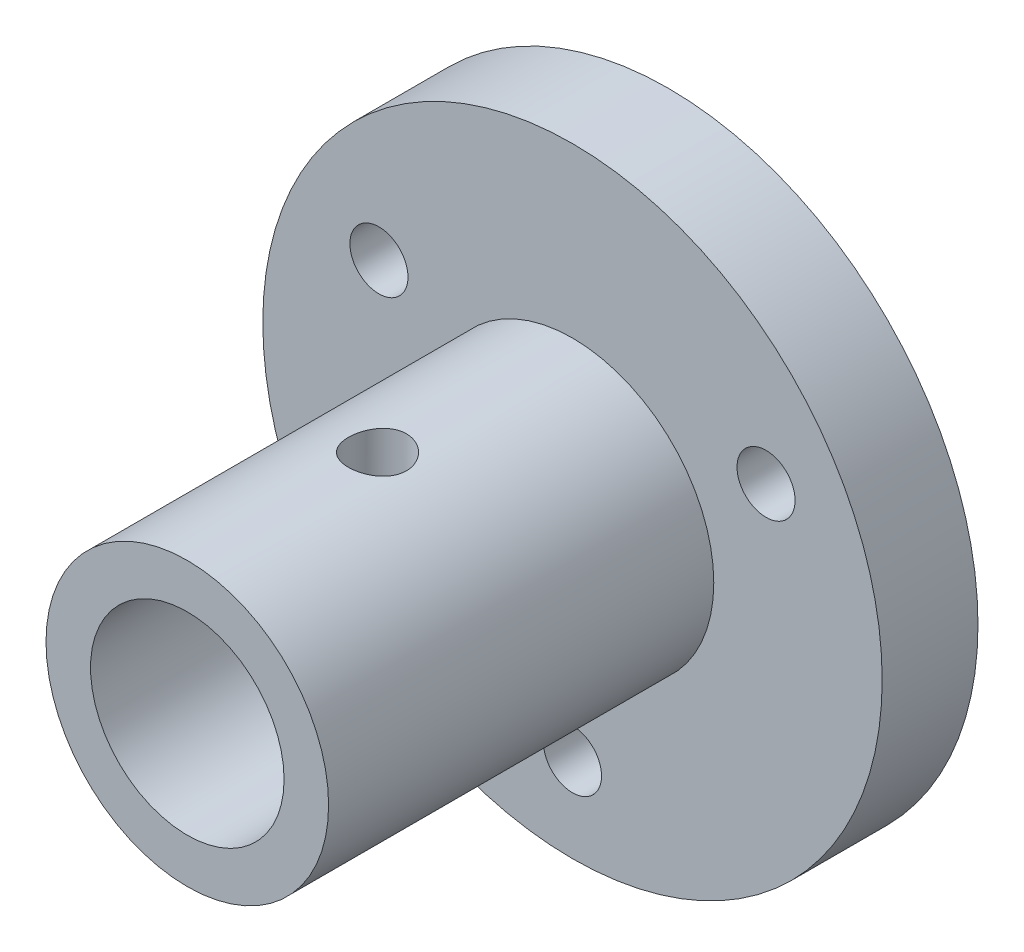
ISO-10303-21;
HEADER;
FILE_DESCRIPTION(('STEP AP214'),'2;1');
FILE_NAME('part.step','',(''),(''),'','','');
FILE_SCHEMA(('AUTOMOTIVE_DESIGN { 1 0 10303 214 1 1 1 1 }'));
ENDSEC;
DATA;
#1=APPLICATION_CONTEXT('core data for automotive mechanical design processes');
#2=APPLICATION_PROTOCOL_DEFINITION('international standard','automotive_design',2000,#1);
#3=PRODUCT_CONTEXT('',#1,'mechanical');
#4=PRODUCT('Part','Part','',(#3));
#5=PRODUCT_RELATED_PRODUCT_CATEGORY('part','',(#4));
#6=PRODUCT_DEFINITION_FORMATION('','',#4);
#7=PRODUCT_DEFINITION_CONTEXT('part definition',#1,'design');
#8=PRODUCT_DEFINITION('design','',#6,#7);
#9=PRODUCT_DEFINITION_SHAPE('','',#8);
#10=(LENGTH_UNIT() NAMED_UNIT(*) SI_UNIT(.MILLI.,.METRE.));
#11=(NAMED_UNIT(*) PLANE_ANGLE_UNIT() SI_UNIT($,.RADIAN.));
#12=(NAMED_UNIT(*) SI_UNIT($,.STERADIAN.) SOLID_ANGLE_UNIT());
#13=UNCERTAINTY_MEASURE_WITH_UNIT(LENGTH_MEASURE(1.E-05),#10,'distance_accuracy_value','');
#14=(GEOMETRIC_REPRESENTATION_CONTEXT(3) GLOBAL_UNCERTAINTY_ASSIGNED_CONTEXT((#13)) GLOBAL_UNIT_ASSIGNED_CONTEXT((#10,
#11,#12)) REPRESENTATION_CONTEXT('',''));
#15=CARTESIAN_POINT('',(0.,0.,0.));
#16=DIRECTION('',(0.,0.,1.));
#17=DIRECTION('',(1.,0.,0.));
#18=AXIS2_PLACEMENT_3D('',#15,#16,#17);
#19=CARTESIAN_POINT('',(0.,0.,9.9));
#20=DIRECTION('',(0.,0.,1.));
#21=DIRECTION('',(1.,0.,0.));
#22=AXIS2_PLACEMENT_3D('',#19,#20,#21);
#23=PLANE('',#22);
#24=CARTESIAN_POINT('',(0.,0.,9.9));
#25=DIRECTION('',(0.,0.,1.));
#26=DIRECTION('',(1.,0.,0.));
#27=AXIS2_PLACEMENT_3D('',#24,#25,#26);
#28=CIRCLE('',#27,14.6);
#29=CARTESIAN_POINT('',(14.6,0.,9.9));
#30=VERTEX_POINT('',#29);
#31=EDGE_CURVE('E144',#30,#30,#28,.T.);
#32=ORIENTED_EDGE('',*,*,#31,.F.);
#33=EDGE_LOOP('',(#32));
#34=FACE_BOUND('',#33,.T.);
#35=CARTESIAN_POINT('',(0.,-23.094010767585,9.9));
#36=DIRECTION('',(0.,0.,1.));
#37=DIRECTION('',(1.,0.,0.));
#38=AXIS2_PLACEMENT_3D('',#35,#36,#37);
#39=CIRCLE('',#38,3.);
#40=CARTESIAN_POINT('',(3.,-23.094010767585,9.9));
#41=VERTEX_POINT('',#40);
#42=EDGE_CURVE('E148',#41,#41,#39,.T.);
#43=ORIENTED_EDGE('',*,*,#42,.F.);
#44=EDGE_LOOP('',(#43));
#45=FACE_BOUND('',#44,.T.);
#46=CARTESIAN_POINT('',(0.,0.,9.9));
#47=DIRECTION('',(0.,0.,1.));
#48=DIRECTION('',(1.,0.,0.));
#49=AXIS2_PLACEMENT_3D('',#46,#47,#48);
#50=CIRCLE('',#49,32.);
#51=CARTESIAN_POINT('',(32.,0.,9.9));
#52=VERTEX_POINT('',#51);
#53=EDGE_CURVE('E51',#52,#52,#50,.T.);
#54=ORIENTED_EDGE('',*,*,#53,.T.);
#55=EDGE_LOOP('',(#54));
#56=FACE_BOUND('',#55,.T.);
#57=CARTESIAN_POINT('',(20.,11.5470053837925,9.9));
#58=DIRECTION('',(0.,0.,1.));
#59=DIRECTION('',(1.,0.,0.));
#60=AXIS2_PLACEMENT_3D('',#57,#58,#59);
#61=CIRCLE('',#60,3.);
#62=CARTESIAN_POINT('',(23.,11.5470053837925,9.9));
#63=VERTEX_POINT('',#62);
#64=EDGE_CURVE('E154',#63,#63,#61,.T.);
#65=ORIENTED_EDGE('',*,*,#64,.F.);
#66=EDGE_LOOP('',(#65));
#67=FACE_BOUND('',#66,.T.);
#68=CARTESIAN_POINT('',(-20.,11.5470053837925,9.9));
#69=DIRECTION('',(0.,0.,1.));
#70=DIRECTION('',(1.,0.,0.));
#71=AXIS2_PLACEMENT_3D('',#68,#69,#70);
#72=CIRCLE('',#71,3.);
#73=CARTESIAN_POINT('',(-17.,11.5470053837925,9.9));
#74=VERTEX_POINT('',#73);
#75=EDGE_CURVE('E136',#74,#74,#72,.T.);
#76=ORIENTED_EDGE('',*,*,#75,.F.);
#77=EDGE_LOOP('',(#76));
#78=FACE_BOUND('',#77,.T.);
#79=ADVANCED_FACE('F37',(#34,#45,#56,#67,#78),#23,.T.);
#80=CARTESIAN_POINT('',(0.,0.,0.));
#81=DIRECTION('',(0.,0.,1.));
#82=DIRECTION('',(1.,0.,0.));
#83=AXIS2_PLACEMENT_3D('',#80,#81,#82);
#84=PLANE('',#83);
#85=CARTESIAN_POINT('',(0.,0.,0.));
#86=DIRECTION('',(0.,0.,1.));
#87=DIRECTION('',(1.,0.,0.));
#88=AXIS2_PLACEMENT_3D('',#85,#86,#87);
#89=CIRCLE('',#88,32.);
#90=CARTESIAN_POINT('',(32.,0.,0.));
#91=VERTEX_POINT('',#90);
#92=EDGE_CURVE('E57',#91,#91,#89,.T.);
#93=ORIENTED_EDGE('',*,*,#92,.F.);
#94=EDGE_LOOP('',(#93));
#95=FACE_BOUND('',#94,.T.);
#96=CARTESIAN_POINT('',(20.,11.5470053837925,0.));
#97=DIRECTION('',(0.,0.,1.));
#98=DIRECTION('',(1.,0.,0.));
#99=AXIS2_PLACEMENT_3D('',#96,#97,#98);
#100=CIRCLE('',#99,3.);
#101=CARTESIAN_POINT('',(23.,11.5470053837925,0.));
#102=VERTEX_POINT('',#101);
#103=EDGE_CURVE('E126',#102,#102,#100,.T.);
#104=ORIENTED_EDGE('',*,*,#103,.T.);
#105=EDGE_LOOP('',(#104));
#106=FACE_BOUND('',#105,.T.);
#107=CARTESIAN_POINT('',(0.,-23.094010767585,0.));
#108=DIRECTION('',(0.,0.,1.));
#109=DIRECTION('',(1.,0.,0.));
#110=AXIS2_PLACEMENT_3D('',#107,#108,#109);
#111=CIRCLE('',#110,3.);
#112=CARTESIAN_POINT('',(3.,-23.094010767585,0.));
#113=VERTEX_POINT('',#112);
#114=EDGE_CURVE('E130',#113,#113,#111,.T.);
#115=ORIENTED_EDGE('',*,*,#114,.T.);
#116=EDGE_LOOP('',(#115));
#117=FACE_BOUND('',#116,.T.);
#118=CARTESIAN_POINT('',(-20.,11.5470053837925,0.));
#119=DIRECTION('',(0.,0.,1.));
#120=DIRECTION('',(1.,0.,0.));
#121=AXIS2_PLACEMENT_3D('',#118,#119,#120);
#122=CIRCLE('',#121,3.);
#123=CARTESIAN_POINT('',(-17.,11.5470053837925,0.));
#124=VERTEX_POINT('',#123);
#125=EDGE_CURVE('E133',#124,#124,#122,.T.);
#126=ORIENTED_EDGE('',*,*,#125,.T.);
#127=EDGE_LOOP('',(#126));
#128=FACE_BOUND('',#127,.T.);
#129=ADVANCED_FACE('F111',(#95,#106,#117,#128),#84,.F.);
#130=CARTESIAN_POINT('',(0.,0.,9.9));
#131=DIRECTION('',(0.,0.,-1.));
#132=DIRECTION('',(-1.,0.,0.));
#133=AXIS2_PLACEMENT_3D('',#130,#131,#132);
#134=CYLINDRICAL_SURFACE('',#133,32.);
#135=ORIENTED_EDGE('',*,*,#53,.F.);
#136=EDGE_LOOP('',(#135));
#137=FACE_BOUND('',#136,.T.);
#138=ORIENTED_EDGE('',*,*,#92,.T.);
#139=EDGE_LOOP('',(#138));
#140=FACE_BOUND('',#139,.T.);
#141=ADVANCED_FACE('F39',(#137,#140),#134,.T.);
#142=CARTESIAN_POINT('',(20.,11.5470053837925,9.9));
#143=DIRECTION('',(0.,0.,-1.));
#144=DIRECTION('',(-1.,0.,0.));
#145=AXIS2_PLACEMENT_3D('',#142,#143,#144);
#146=CYLINDRICAL_SURFACE('',#145,3.);
#147=ORIENTED_EDGE('',*,*,#64,.T.);
#148=EDGE_LOOP('',(#147));
#149=FACE_BOUND('',#148,.T.);
#150=ORIENTED_EDGE('',*,*,#103,.F.);
#151=EDGE_LOOP('',(#150));
#152=FACE_BOUND('',#151,.T.);
#153=ADVANCED_FACE('F105',(#149,#152),#146,.F.);
#154=CARTESIAN_POINT('',(0.,-23.094010767585,9.9));
#155=DIRECTION('',(0.,0.,-1.));
#156=DIRECTION('',(-1.,0.,0.));
#157=AXIS2_PLACEMENT_3D('',#154,#155,#156);
#158=CYLINDRICAL_SURFACE('',#157,3.);
#159=ORIENTED_EDGE('',*,*,#42,.T.);
#160=EDGE_LOOP('',(#159));
#161=FACE_BOUND('',#160,.T.);
#162=ORIENTED_EDGE('',*,*,#114,.F.);
#163=EDGE_LOOP('',(#162));
#164=FACE_BOUND('',#163,.T.);
#165=ADVANCED_FACE('F101',(#161,#164),#158,.F.);
#166=CARTESIAN_POINT('',(-20.,11.5470053837925,9.9));
#167=DIRECTION('',(0.,0.,-1.));
#168=DIRECTION('',(-1.,0.,0.));
#169=AXIS2_PLACEMENT_3D('',#166,#167,#168);
#170=CYLINDRICAL_SURFACE('',#169,3.);
#171=ORIENTED_EDGE('',*,*,#75,.T.);
#172=EDGE_LOOP('',(#171));
#173=FACE_BOUND('',#172,.T.);
#174=ORIENTED_EDGE('',*,*,#125,.F.);
#175=EDGE_LOOP('',(#174));
#176=FACE_BOUND('',#175,.T.);
#177=ADVANCED_FACE('F97',(#173,#176),#170,.F.);
#178=CARTESIAN_POINT('',(0.,0.,49.7));
#179=DIRECTION('',(0.,0.,1.));
#180=DIRECTION('',(1.,0.,0.));
#181=AXIS2_PLACEMENT_3D('',#178,#179,#180);
#182=PLANE('',#181);
#183=CARTESIAN_POINT('',(0.,0.,49.7));
#184=DIRECTION('',(0.,0.,1.));
#185=DIRECTION('',(1.,0.,0.));
#186=AXIS2_PLACEMENT_3D('',#183,#184,#185);
#187=CIRCLE('',#186,14.6);
#188=CARTESIAN_POINT('',(14.6,0.,49.7));
#189=VERTEX_POINT('',#188);
#190=EDGE_CURVE('E137',#189,#189,#187,.T.);
#191=ORIENTED_EDGE('',*,*,#190,.T.);
#192=EDGE_LOOP('',(#191));
#193=FACE_BOUND('',#192,.T.);
#194=CARTESIAN_POINT('',(0.,0.,49.7));
#195=DIRECTION('',(0.,0.,1.));
#196=DIRECTION('',(1.,0.,0.));
#197=AXIS2_PLACEMENT_3D('',#194,#195,#196);
#198=CIRCLE('',#197,10.);
#199=CARTESIAN_POINT('',(10.,0.,49.7));
#200=VERTEX_POINT('',#199);
#201=EDGE_CURVE('E173',#200,#200,#198,.T.);
#202=ORIENTED_EDGE('',*,*,#201,.F.);
#203=EDGE_LOOP('',(#202));
#204=FACE_BOUND('',#203,.T.);
#205=ADVANCED_FACE('F95',(#193,#204),#182,.T.);
#206=CARTESIAN_POINT('',(0.,0.,49.7));
#207=DIRECTION('',(0.,0.,-1.));
#208=DIRECTION('',(-1.,0.,0.));
#209=AXIS2_PLACEMENT_3D('',#206,#207,#208);
#210=CYLINDRICAL_SURFACE('',#209,14.6);
#211=CARTESIAN_POINT('',(0.,-14.6,33.05));
#212=CARTESIAN_POINT('',(0.166633377005211,-14.5999969182109,33.0499939875564));
#213=CARTESIAN_POINT('',(0.333341784113637,-14.5971180613124,33.0360697584777));
#214=CARTESIAN_POINT('',(0.662039861848743,-14.5859115188509,32.9807888195421));
#215=CARTESIAN_POINT('',(0.824025789869709,-14.577579628086,32.9394109379845));
#216=CARTESIAN_POINT('',(1.13847954897907,-14.5563966332869,32.830560211012));
#217=CARTESIAN_POINT('',(1.2909565623748,-14.5435499710842,32.7631130072606));
#218=CARTESIAN_POINT('',(1.58242115066612,-14.5147311294236,32.6041159148075));
#219=CARTESIAN_POINT('',(1.72140939815028,-14.4987591059252,32.5125672287208));
#220=CARTESIAN_POINT('',(1.98394160788817,-14.4651905104871,32.3065829450867));
#221=CARTESIAN_POINT('',(2.10726561222999,-14.4475757932375,32.191869935958));
#222=CARTESIAN_POINT('',(2.33306326838937,-14.412837915702,31.9434094140278));
#223=CARTESIAN_POINT('',(2.43553522882711,-14.3957147953878,31.8096603586423));
#224=CARTESIAN_POINT('',(2.61766595214403,-14.3637212074771,31.5253296483046));
#225=CARTESIAN_POINT('',(2.69709513793058,-14.3488740607833,31.3745980786085));
#226=CARTESIAN_POINT('',(2.82941433253285,-14.3233719815213,31.0615725218656));
#227=CARTESIAN_POINT('',(2.8823071178752,-14.3127166103891,30.8992797465079));
#228=CARTESIAN_POINT('',(2.95933433606094,-14.2969884735749,30.5701108694876));
#229=CARTESIAN_POINT('',(2.98385570508323,-14.2918406692852,30.4033289725136));
#230=CARTESIAN_POINT('',(3.00464624392415,-14.2874848040001,30.0679450611205));
#231=CARTESIAN_POINT('',(3.0009184668875,-14.2882761011115,29.8993432453635));
#232=CARTESIAN_POINT('',(2.96562895838244,-14.2956409222609,29.5679492318097));
#233=CARTESIAN_POINT('',(2.93451246175025,-14.3021219488913,29.4051072581875));
#234=CARTESIAN_POINT('',(2.84603232070754,-14.3199901686138,29.0870053022098));
#235=CARTESIAN_POINT('',(2.788667360196,-14.3313776077122,28.9317457004674));
#236=CARTESIAN_POINT('',(2.64889819518435,-14.3578691706868,28.6319415738694));
#237=CARTESIAN_POINT('',(2.56631901964995,-14.3729991213359,28.4874809975888));
#238=CARTESIAN_POINT('',(2.37858887523347,-14.4052545768745,28.214300952785));
#239=CARTESIAN_POINT('',(2.27343517443705,-14.4223803231755,28.0855833924057));
#240=CARTESIAN_POINT('',(2.04116471520823,-14.4570973640614,27.8449756900215));
#241=CARTESIAN_POINT('',(1.91366834489734,-14.4746913188376,27.7334520676003));
#242=CARTESIAN_POINT('',(1.6415892274147,-14.5080646509021,27.5333146880252));
#243=CARTESIAN_POINT('',(1.497006237179,-14.5238440023708,27.4447012568349));
#244=CARTESIAN_POINT('',(1.19443953148626,-14.5518523717957,27.2928254573483));
#245=CARTESIAN_POINT('',(1.03643331110216,-14.564075269061,27.2296067232555));
#246=CARTESIAN_POINT('',(0.711735220012307,-14.5835473921338,27.130714994033));
#247=CARTESIAN_POINT('',(0.545044463968484,-14.5907972545475,27.0950384731067));
#248=CARTESIAN_POINT('',(0.210857036553483,-14.5994172317983,27.0527668224685));
#249=CARTESIAN_POINT('',(0.0434263131154538,-14.60088869373,27.0456703709297));
#250=CARTESIAN_POINT('',(-0.290228334883841,-14.5980682869987,27.0594077144487));
#251=CARTESIAN_POINT('',(-0.456452330641598,-14.5937767611742,27.0802398480418));
#252=CARTESIAN_POINT('',(-0.781345314395098,-14.5799761514448,27.1488267155744));
#253=CARTESIAN_POINT('',(-0.940071267549888,-14.5705172562301,27.1963225953927));
#254=CARTESIAN_POINT('',(-1.2473055703844,-14.5474391036697,27.316604595902));
#255=CARTESIAN_POINT('',(-1.3958131223451,-14.5338195219626,27.3893926884004));
#256=CARTESIAN_POINT('',(-1.68049762867288,-14.5036789258417,27.5592660638503));
#257=CARTESIAN_POINT('',(-1.81649193589808,-14.4871229279649,27.6566510980625));
#258=CARTESIAN_POINT('',(-2.0703883746622,-14.453024989171,27.8725545013176));
#259=CARTESIAN_POINT('',(-2.18828844796234,-14.4354829363987,27.9910752712632));
#260=CARTESIAN_POINT('',(-2.40459801034589,-14.4010459459494,28.2481733703916));
#261=CARTESIAN_POINT('',(-2.50266245744593,-14.3841660094418,28.3870433643473));
#262=CARTESIAN_POINT('',(-2.67407551033463,-14.3532901068317,28.6795783187771));
#263=CARTESIAN_POINT('',(-2.74742513211914,-14.3392940221867,28.8332426707394));
#264=CARTESIAN_POINT('',(-2.8668637794127,-14.3158932892074,29.1502127631897));
#265=CARTESIAN_POINT('',(-2.91309804599263,-14.3064642262667,29.3134618855721));
#266=CARTESIAN_POINT('',(-2.97743018185563,-14.2932154447435,29.6456274258376));
#267=CARTESIAN_POINT('',(-2.99553195177979,-14.2893949485232,29.8145430547269));
#268=CARTESIAN_POINT('',(-3.00293466093762,-14.2878407207398,30.1497784419471));
#269=CARTESIAN_POINT('',(-2.99278131823603,-14.2899916552887,30.3160858528177));
#270=CARTESIAN_POINT('',(-2.94517085564493,-14.2998793491826,30.6445673762651));
#271=CARTESIAN_POINT('',(-2.90771398269054,-14.3076160580094,30.8067415262097));
#272=CARTESIAN_POINT('',(-2.80680901965499,-14.327750658765,31.12198125967));
#273=CARTESIAN_POINT('',(-2.74343141015599,-14.3401359034906,31.2750702638829));
#274=CARTESIAN_POINT('',(-2.59254816370386,-14.3681786066726,31.5685262787084));
#275=CARTESIAN_POINT('',(-2.50504036139108,-14.3838363587618,31.7088921460882));
#276=CARTESIAN_POINT('',(-2.30653215096687,-14.4170103674048,31.9756271589619));
#277=CARTESIAN_POINT('',(-2.19513908694041,-14.4345548855488,32.1017006234524));
#278=CARTESIAN_POINT('',(-1.95282895906888,-14.4693265333104,32.333545746749));
#279=CARTESIAN_POINT('',(-1.82190740982402,-14.4865535889878,32.4393127286628));
#280=CARTESIAN_POINT('',(-1.54249946162868,-14.518976373148,32.6286617062105));
#281=CARTESIAN_POINT('',(-1.39383336889653,-14.5341472904643,32.7119829852152));
#282=CARTESIAN_POINT('',(-1.08433553229311,-14.5605030609518,32.8523265749854));
#283=CARTESIAN_POINT('',(-0.92351468649479,-14.5716914346961,32.9093721267084));
#284=CARTESIAN_POINT('',(-0.63532265935256,-14.5866978320433,32.9847450580274));
#285=CARTESIAN_POINT('',(-0.509570139843861,-14.5916564747335,33.009171179745));
#286=CARTESIAN_POINT('',(-0.255893112768169,-14.5983086847068,33.0418006744142));
#287=CARTESIAN_POINT('',(-0.127968681672888,-14.6000023667077,33.0500046173492));
#288=CARTESIAN_POINT('',(0.,-14.6,33.05));
#289=B_SPLINE_CURVE_WITH_KNOTS('',3,(#211,#212,#213,#214,#215,#216,#217,#218,#219,#220,#221,
#222,#223,#224,#225,#226,#227,#228,#229,#230,#231,#232,#233,#234,#235,#236,#237,#238,#239,#240,
#241,#242,#243,#244,#245,#246,#247,#248,#249,#250,#251,#252,#253,#254,#255,#256,#257,#258,#259,
#260,#261,#262,#263,#264,#265,#266,#267,#268,#269,#270,#271,#272,#273,#274,#275,#276,#277,#278,
#279,#280,#281,#282,#283,#284,#285,#286,#287,#288),.UNSPECIFIED.,.T.,.F.,(4,2,2,2,2,2,2,2,2,2,2,
2,2,2,2,2,2,2,2,2,2,2,2,2,2,2,2,2,2,2,2,2,2,2,2,2,2,2,4),(0.,0.499431908281442,
0.999249416697518,1.49857655289747,1.99787877840735,2.50355891165817,3.00928004599943,
3.51987909004206,4.03042469851552,4.53392208786281,5.03736506039832,5.53277208571102,
6.02820395351141,6.5271551089866,7.0261666803933,7.53466708974391,8.04317473358533,
8.55255241650952,9.06186488099989,9.56220355268085,10.062512460659,10.558046287335,
11.0536187550179,11.5555494146976,12.0575371272846,12.5676215565365,13.0776850142902,
13.5849908007718,14.0922262417588,14.5897333171287,15.0872358930642,15.5833946187815,
16.0795978825561,16.5846874900775,17.0898932882465,17.6007363468644,18.1111266915164,
18.494686634662,18.878233100783),.UNSPECIFIED.);
#290=CARTESIAN_POINT('',(0.,-14.6,33.05));
#291=VERTEX_POINT('',#290);
#292=EDGE_CURVE('E86',#291,#291,#289,.T.);
#293=ORIENTED_EDGE('',*,*,#292,.T.);
#294=EDGE_LOOP('',(#293));
#295=FACE_BOUND('',#294,.T.);
#296=CARTESIAN_POINT('',(0.,14.6,33.05));
#297=CARTESIAN_POINT('',(-0.166633377005207,14.5999969182109,33.0499939875564));
#298=CARTESIAN_POINT('',(-0.333341784113633,14.5971180613124,33.0360697584777));
#299=CARTESIAN_POINT('',(-0.662039861848739,14.5859115188509,32.9807888195421));
#300=CARTESIAN_POINT('',(-0.824025789869705,14.577579628086,32.9394109379845));
#301=CARTESIAN_POINT('',(-1.13847954897906,14.5563966332869,32.830560211012));
#302=CARTESIAN_POINT('',(-1.2909565623748,14.5435499710842,32.7631130072606));
#303=CARTESIAN_POINT('',(-1.58242115066612,14.5147311294236,32.6041159148075));
#304=CARTESIAN_POINT('',(-1.72140939815028,14.4987591059252,32.5125672287208));
#305=CARTESIAN_POINT('',(-1.98394160788816,14.4651905104871,32.3065829450867));
#306=CARTESIAN_POINT('',(-2.10726561222998,14.4475757932375,32.191869935958));
#307=CARTESIAN_POINT('',(-2.33306326838936,14.412837915702,31.9434094140278));
#308=CARTESIAN_POINT('',(-2.43553522882711,14.3957147953878,31.8096603586423));
#309=CARTESIAN_POINT('',(-2.61766595214403,14.3637212074771,31.5253296483046));
#310=CARTESIAN_POINT('',(-2.69709513793058,14.3488740607834,31.3745980786085));
#311=CARTESIAN_POINT('',(-2.82941433253285,14.3233719815213,31.0615725218656));
#312=CARTESIAN_POINT('',(-2.88230711787519,14.3127166103891,30.8992797465079));
#313=CARTESIAN_POINT('',(-2.95933433606094,14.2969884735749,30.5701108694876));
#314=CARTESIAN_POINT('',(-2.98385570508322,14.2918406692852,30.4033289725136));
#315=CARTESIAN_POINT('',(-3.00464624392415,14.2874848040001,30.0679450611205));
#316=CARTESIAN_POINT('',(-3.0009184668875,14.2882761011115,29.8993432453635));
#317=CARTESIAN_POINT('',(-2.96562895838243,14.2956409222609,29.5679492318097));
#318=CARTESIAN_POINT('',(-2.93451246175025,14.3021219488913,29.4051072581875));
#319=CARTESIAN_POINT('',(-2.84603232070753,14.3199901686138,29.0870053022098));
#320=CARTESIAN_POINT('',(-2.788667360196,14.3313776077122,28.9317457004674));
#321=CARTESIAN_POINT('',(-2.64889819518435,14.3578691706868,28.6319415738694));
#322=CARTESIAN_POINT('',(-2.56631901964995,14.3729991213359,28.4874809975888));
#323=CARTESIAN_POINT('',(-2.37858887523347,14.4052545768745,28.214300952785));
#324=CARTESIAN_POINT('',(-2.27343517443705,14.4223803231755,28.0855833924057));
#325=CARTESIAN_POINT('',(-2.04116471520823,14.4570973640614,27.8449756900215));
#326=CARTESIAN_POINT('',(-1.91366834489734,14.4746913188376,27.7334520676003));
#327=CARTESIAN_POINT('',(-1.6415892274147,14.5080646509021,27.5333146880252));
#328=CARTESIAN_POINT('',(-1.497006237179,14.5238440023708,27.4447012568349));
#329=CARTESIAN_POINT('',(-1.19443953148626,14.5518523717957,27.2928254573483));
#330=CARTESIAN_POINT('',(-1.03643331110216,14.564075269061,27.2296067232555));
#331=CARTESIAN_POINT('',(-0.711735220012306,14.5835473921338,27.130714994033));
#332=CARTESIAN_POINT('',(-0.545044463968482,14.5907972545475,27.0950384731067));
#333=CARTESIAN_POINT('',(-0.210857036553481,14.5994172317983,27.0527668224685));
#334=CARTESIAN_POINT('',(-0.0434263131154529,14.60088869373,27.0456703709297));
#335=CARTESIAN_POINT('',(0.290228334883842,14.5980682869987,27.0594077144487));
#336=CARTESIAN_POINT('',(0.456452330641599,14.5937767611742,27.0802398480418));
#337=CARTESIAN_POINT('',(0.781345314395099,14.5799761514448,27.1488267155744));
#338=CARTESIAN_POINT('',(0.940071267549889,14.5705172562301,27.1963225953927));
#339=CARTESIAN_POINT('',(1.2473055703844,14.5474391036697,27.316604595902));
#340=CARTESIAN_POINT('',(1.3958131223451,14.5338195219626,27.3893926884004));
#341=CARTESIAN_POINT('',(1.68049762867288,14.5036789258417,27.5592660638503));
#342=CARTESIAN_POINT('',(1.81649193589808,14.4871229279649,27.6566510980625));
#343=CARTESIAN_POINT('',(2.0703883746622,14.453024989171,27.8725545013176));
#344=CARTESIAN_POINT('',(2.18828844796235,14.4354829363987,27.9910752712632));
#345=CARTESIAN_POINT('',(2.40459801034589,14.4010459459494,28.2481733703916));
#346=CARTESIAN_POINT('',(2.50266245744593,14.3841660094418,28.3870433643473));
#347=CARTESIAN_POINT('',(2.67407551033463,14.3532901068317,28.6795783187771));
#348=CARTESIAN_POINT('',(2.74742513211914,14.3392940221867,28.8332426707394));
#349=CARTESIAN_POINT('',(2.86686377941271,14.3158932892074,29.1502127631897));
#350=CARTESIAN_POINT('',(2.91309804599263,14.3064642262667,29.3134618855721));
#351=CARTESIAN_POINT('',(2.97743018185563,14.2932154447435,29.6456274258376));
#352=CARTESIAN_POINT('',(2.9955319517798,14.2893949485232,29.8145430547269));
#353=CARTESIAN_POINT('',(3.00293466093763,14.2878407207398,30.1497784419471));
#354=CARTESIAN_POINT('',(2.99278131823603,14.2899916552887,30.3160858528177));
#355=CARTESIAN_POINT('',(2.94517085564493,14.2998793491826,30.6445673762651));
#356=CARTESIAN_POINT('',(2.90771398269055,14.3076160580094,30.8067415262097));
#357=CARTESIAN_POINT('',(2.80680901965499,14.327750658765,31.12198125967));
#358=CARTESIAN_POINT('',(2.74343141015599,14.3401359034906,31.2750702638829));
#359=CARTESIAN_POINT('',(2.59254816370386,14.3681786066725,31.5685262787084));
#360=CARTESIAN_POINT('',(2.50504036139109,14.3838363587618,31.7088921460882));
#361=CARTESIAN_POINT('',(2.30653215096687,14.4170103674048,31.9756271589619));
#362=CARTESIAN_POINT('',(2.19513908694042,14.4345548855488,32.1017006234524));
#363=CARTESIAN_POINT('',(1.95282895906888,14.4693265333104,32.333545746749));
#364=CARTESIAN_POINT('',(1.82190740982402,14.4865535889878,32.4393127286628));
#365=CARTESIAN_POINT('',(1.54249946162868,14.518976373148,32.6286617062105));
#366=CARTESIAN_POINT('',(1.39383336889653,14.5341472904643,32.7119829852152));
#367=CARTESIAN_POINT('',(1.08433553229311,14.5605030609518,32.8523265749854));
#368=CARTESIAN_POINT('',(0.923514686494794,14.5716914346961,32.9093721267084));
#369=CARTESIAN_POINT('',(0.635322659352564,14.5866978320433,32.9847450580274));
#370=CARTESIAN_POINT('',(0.509570139843864,14.5916564747335,33.009171179745));
#371=CARTESIAN_POINT('',(0.255893112768173,14.5983086847068,33.0418006744142));
#372=CARTESIAN_POINT('',(0.127968681672891,14.6000023667077,33.0500046173492));
#373=CARTESIAN_POINT('',(0.,14.6,33.05));
#374=B_SPLINE_CURVE_WITH_KNOTS('',3,(#296,#297,#298,#299,#300,#301,#302,#303,#304,#305,#306,
#307,#308,#309,#310,#311,#312,#313,#314,#315,#316,#317,#318,#319,#320,#321,#322,#323,#324,#325,
#326,#327,#328,#329,#330,#331,#332,#333,#334,#335,#336,#337,#338,#339,#340,#341,#342,#343,#344,
#345,#346,#347,#348,#349,#350,#351,#352,#353,#354,#355,#356,#357,#358,#359,#360,#361,#362,#363,
#364,#365,#366,#367,#368,#369,#370,#371,#372,#373),.UNSPECIFIED.,.T.,.F.,(4,2,2,2,2,2,2,2,2,2,2,
2,2,2,2,2,2,2,2,2,2,2,2,2,2,2,2,2,2,2,2,2,2,2,2,2,2,2,4),(0.,0.499431908281441,
0.999249416697517,1.49857655289747,1.99787877840735,2.50355891165816,3.00928004599943,
3.51987909004206,4.03042469851552,4.53392208786281,5.03736506039832,5.53277208571102,
6.02820395351141,6.5271551089866,7.0261666803933,7.5346670897439,8.04317473358532,
8.55255241650952,9.06186488099989,9.56220355268085,10.062512460659,10.558046287335,
11.0536187550179,11.5555494146976,12.0575371272846,12.5676215565365,13.0776850142902,
13.5849908007719,14.0922262417588,14.5897333171287,15.0872358930642,15.5833946187815,
16.0795978825561,16.5846874900775,17.0898932882465,17.6007363468644,18.1111266915164,
18.494686634662,18.878233100783),.UNSPECIFIED.);
#375=CARTESIAN_POINT('',(0.,14.6,33.05));
#376=VERTEX_POINT('',#375);
#377=EDGE_CURVE('E79',#376,#376,#374,.T.);
#378=ORIENTED_EDGE('',*,*,#377,.T.);
#379=EDGE_LOOP('',(#378));
#380=FACE_BOUND('',#379,.T.);
#381=ORIENTED_EDGE('',*,*,#190,.F.);
#382=EDGE_LOOP('',(#381));
#383=FACE_BOUND('',#382,.T.);
#384=ORIENTED_EDGE('',*,*,#31,.T.);
#385=EDGE_LOOP('',(#384));
#386=FACE_BOUND('',#385,.T.);
#387=ADVANCED_FACE('F91',(#295,#380,#383,#386),#210,.T.);
#388=CARTESIAN_POINT('',(0.,0.,49.7));
#389=DIRECTION('',(0.,0.,-1.));
#390=DIRECTION('',(-1.,0.,0.));
#391=AXIS2_PLACEMENT_3D('',#388,#389,#390);
#392=CYLINDRICAL_SURFACE('',#391,10.);
#393=CARTESIAN_POINT('',(0.,-9.99999999999999,33.05));
#394=CARTESIAN_POINT('',(0.164577225506601,-9.999998585011,33.0499980050302));
#395=CARTESIAN_POINT('',(0.32917463670306,-9.99589831387907,33.0364122727521));
#396=CARTESIAN_POINT('',(0.653576250609762,-9.97994211187382,32.9825572915558));
#397=CARTESIAN_POINT('',(0.81337900882284,-9.96808386779384,32.9422800839533));
#398=CARTESIAN_POINT('',(1.12346541550905,-9.93791105003673,32.8365079661795));
#399=CARTESIAN_POINT('',(1.27376272879075,-9.91960600500851,32.7710502607621));
#400=CARTESIAN_POINT('',(1.56124836210626,-9.87844218475291,32.6169278138883));
#401=CARTESIAN_POINT('',(1.69843493493934,-9.85558280384133,32.5282599852092));
#402=CARTESIAN_POINT('',(1.95974359436749,-9.80701474385548,32.3275519850547));
#403=CARTESIAN_POINT('',(2.08343614248868,-9.78124767314073,32.2149667482282));
#404=CARTESIAN_POINT('',(2.31049841846647,-9.73011668420884,31.9707815401796));
#405=CARTESIAN_POINT('',(2.41386472654881,-9.70475283449003,31.8391783757501));
#406=CARTESIAN_POINT('',(2.59960075447415,-9.65668227987544,31.5570584939248));
#407=CARTESIAN_POINT('',(2.68144618044427,-9.63404813327749,31.4061830780185));
#408=CARTESIAN_POINT('',(2.81842789549521,-9.59487240788062,31.0920214915394));
#409=CARTESIAN_POINT('',(2.87357059839947,-9.57832936626621,30.9287383121441));
#410=CARTESIAN_POINT('',(2.95403267365303,-9.55381741676868,30.5992194677391));
#411=CARTESIAN_POINT('',(2.98014392469355,-9.54562138649067,30.4331945122721));
#412=CARTESIAN_POINT('',(3.00427461229344,-9.53805579499534,30.0989336875665));
#413=CARTESIAN_POINT('',(3.00230085522157,-9.53868409521142,29.9306983638818));
#414=CARTESIAN_POINT('',(2.97093954399624,-9.54849488135555,29.603232182783));
#415=CARTESIAN_POINT('',(2.94254410525371,-9.55736777198281,29.4438954992755));
#416=CARTESIAN_POINT('',(2.86074840854112,-9.58216712457248,29.1323604274531));
#417=CARTESIAN_POINT('',(2.80734568283282,-9.59809428264701,28.9801627452513));
#418=CARTESIAN_POINT('',(2.67632053307364,-9.63545466149946,28.6847993006785));
#419=CARTESIAN_POINT('',(2.59837633869285,-9.65696032231904,28.5417858320895));
#420=CARTESIAN_POINT('',(2.42070445177367,-9.70301974000129,28.2705359559796));
#421=CARTESIAN_POINT('',(2.32097148005177,-9.72757423493982,28.1423031411724));
#422=CARTESIAN_POINT('',(2.09762581531093,-9.77822022595875,27.898627618476));
#423=CARTESIAN_POINT('',(1.97318981493395,-9.80433308620996,27.7839426719407));
#424=CARTESIAN_POINT('',(1.70652651862794,-9.85424488126517,27.5768920318715));
#425=CARTESIAN_POINT('',(1.56429810372178,-9.8780436703682,27.4845277431711));
#426=CARTESIAN_POINT('',(1.26471007668561,-9.92086320138941,27.3242801550705));
#427=CARTESIAN_POINT('',(1.1072554994959,-9.93985087336628,27.2565649675003));
#428=CARTESIAN_POINT('',(0.782490831207039,-9.97067043664444,27.1488008198007));
#429=CARTESIAN_POINT('',(0.615183503179163,-9.98250432373999,27.108744142935));
#430=CARTESIAN_POINT('',(0.281904485336663,-9.99736729287077,27.0586956442012));
#431=CARTESIAN_POINT('',(0.116100195202374,-10.0006970083558,27.0476768283968));
#432=CARTESIAN_POINT('',(-0.214999211646765,-9.99905846483519,27.0531383114242));
#433=CARTESIAN_POINT('',(-0.38029439338156,-9.99409131355514,27.0696149393029));
#434=CARTESIAN_POINT('',(-0.701807210619393,-9.97661393974325,27.128769222223));
#435=CARTESIAN_POINT('',(-0.858145545228337,-9.96427659598829,27.1708467751617));
#436=CARTESIAN_POINT('',(-1.16150927790904,-9.9334869568307,27.2792864655564));
#437=CARTESIAN_POINT('',(-1.30853355405117,-9.91503392642188,27.3456515220757));
#438=CARTESIAN_POINT('',(-1.5928743789221,-9.87339308702631,27.5025063309623));
#439=CARTESIAN_POINT('',(-1.72988765239934,-9.8501056165928,27.593518681896));
#440=CARTESIAN_POINT('',(-1.9870466159603,-9.80146937528705,27.7964495081056));
#441=CARTESIAN_POINT('',(-2.10718806471188,-9.7761200886242,27.9083732237753));
#442=CARTESIAN_POINT('',(-2.33171489102052,-9.72506343738007,28.1547746167387));
#443=CARTESIAN_POINT('',(-2.43536962463001,-9.69937650065513,28.2899237515437));
#444=CARTESIAN_POINT('',(-2.61857990144313,-9.65153030477949,28.5762558780269));
#445=CARTESIAN_POINT('',(-2.69813607658965,-9.62937095313121,28.7274384491158));
#446=CARTESIAN_POINT('',(-2.83034694254315,-9.5913437922631,29.04106498251));
#447=CARTESIAN_POINT('',(-2.88312693874021,-9.575446756735,29.2034523730757));
#448=CARTESIAN_POINT('',(-2.96043461630306,-9.55183188739737,29.5353759378605));
#449=CARTESIAN_POINT('',(-2.98497197957849,-9.54411125069387,29.7049096415661));
#450=CARTESIAN_POINT('',(-3.0044396896993,-9.53799944941558,30.0387230367768));
#451=CARTESIAN_POINT('',(-3.00056110615887,-9.53923294700395,30.2029273020988));
#452=CARTESIAN_POINT('',(-2.9661501088861,-9.54998802392189,30.5282282068012));
#453=CARTESIAN_POINT('',(-2.93561876249407,-9.55950927135902,30.689324970361));
#454=CARTESIAN_POINT('',(-2.84953777608686,-9.58551527389243,31.0018907982634));
#455=CARTESIAN_POINT('',(-2.79430351014248,-9.60191209104934,31.1534545747174));
#456=CARTESIAN_POINT('',(-2.66063014242147,-9.63980557805265,31.4452848776414));
#457=CARTESIAN_POINT('',(-2.58218659925722,-9.6613032238508,31.5855492352832));
#458=CARTESIAN_POINT('',(-2.40097527610175,-9.70795352855338,31.8563262330525));
#459=CARTESIAN_POINT('',(-2.29742552185995,-9.7332108032858,31.9862975225204));
#460=CARTESIAN_POINT('',(-2.07034869259555,-9.78402640899067,32.2274049966162));
#461=CARTESIAN_POINT('',(-1.94681643426897,-9.80958481647543,32.3385362789356));
#462=CARTESIAN_POINT('',(-1.67893152436651,-9.85901873141573,32.5420468245899));
#463=CARTESIAN_POINT('',(-1.53407577158122,-9.88282319531421,32.6337828937109));
#464=CARTESIAN_POINT('',(-1.23028274796705,-9.92521360911553,32.7914703398081));
#465=CARTESIAN_POINT('',(-1.07135210599791,-9.94380199862114,32.857433776549));
#466=CARTESIAN_POINT('',(-0.761515425310564,-9.97204349938619,32.9557905513055));
#467=CARTESIAN_POINT('',(-0.611573923908468,-9.9824405476214,32.9910233457665));
#468=CARTESIAN_POINT('',(-0.307760390461558,-9.9964188898898,33.0381270504832));
#469=CARTESIAN_POINT('',(-0.153889019716278,-10.0000013230948,33.0500018654096));
#470=CARTESIAN_POINT('',(0.,-9.99999999999999,33.05));
#471=B_SPLINE_CURVE_WITH_KNOTS('',3,(#393,#394,#395,#396,#397,#398,#399,#400,#401,#402,#403,
#404,#405,#406,#407,#408,#409,#410,#411,#412,#413,#414,#415,#416,#417,#418,#419,#420,#421,#422,
#423,#424,#425,#426,#427,#428,#429,#430,#431,#432,#433,#434,#435,#436,#437,#438,#439,#440,#441,
#442,#443,#444,#445,#446,#447,#448,#449,#450,#451,#452,#453,#454,#455,#456,#457,#458,#459,#460,
#461,#462,#463,#464,#465,#466,#467,#468,#469,#470),.UNSPECIFIED.,.T.,.F.,(4,2,2,2,2,2,2,2,2,2,2,
2,2,2,2,2,2,2,2,2,2,2,2,2,2,2,2,2,2,2,2,2,2,2,2,2,2,2,4),(0.,0.49316640722522,0.986479929691999,
1.47906735260175,1.9717203288254,2.47711205896382,2.98258874577266,3.49942962008218,
4.01614629086447,4.51839378713197,5.02051956638179,5.50452033395352,5.98856887316002,
6.47924852894239,6.97004720317111,7.48134208096333,7.99266913062143,8.50742093763377,
9.02202907057616,9.5181761887709,10.0142570710065,10.4991349336465,10.9840710918746,
11.4802261140582,11.9765056400038,12.4908080064564,13.0050968850536,13.516956299025,
14.0286401892057,14.5190031093854,15.0093463933232,15.4936008081456,15.9779479511534,
16.4799385136898,16.9820594980413,17.4988599232246,18.0154182319959,18.4766338387004,
18.9377723390687),.UNSPECIFIED.);
#472=CARTESIAN_POINT('',(0.,-9.99999999999999,33.05));
#473=VERTEX_POINT('',#472);
#474=EDGE_CURVE('E41',#473,#473,#471,.T.);
#475=ORIENTED_EDGE('',*,*,#474,.F.);
#476=EDGE_LOOP('',(#475));
#477=FACE_BOUND('',#476,.T.);
#478=CARTESIAN_POINT('',(0.,10.,33.05));
#479=CARTESIAN_POINT('',(-0.164577225506597,9.99999858501102,33.0499980050302));
#480=CARTESIAN_POINT('',(-0.329174636703056,9.99589831387907,33.0364122727521));
#481=CARTESIAN_POINT('',(-0.653576250609758,9.97994211187381,32.9825572915558));
#482=CARTESIAN_POINT('',(-0.813379008822837,9.96808386779384,32.9422800839533));
#483=CARTESIAN_POINT('',(-1.12346541550905,9.93791105003673,32.8365079661795));
#484=CARTESIAN_POINT('',(-1.27376272879074,9.91960600500851,32.7710502607621));
#485=CARTESIAN_POINT('',(-1.56124836210626,9.87844218475291,32.6169278138883));
#486=CARTESIAN_POINT('',(-1.69843493493934,9.85558280384133,32.5282599852092));
#487=CARTESIAN_POINT('',(-1.95974359436748,9.80701474385548,32.3275519850547));
#488=CARTESIAN_POINT('',(-2.08343614248868,9.78124767314073,32.2149667482282));
#489=CARTESIAN_POINT('',(-2.31049841846647,9.73011668420884,31.9707815401796));
#490=CARTESIAN_POINT('',(-2.41386472654881,9.70475283449003,31.8391783757501));
#491=CARTESIAN_POINT('',(-2.59960075447415,9.65668227987544,31.5570584939248));
#492=CARTESIAN_POINT('',(-2.68144618044427,9.6340481332775,31.4061830780185));
#493=CARTESIAN_POINT('',(-2.8184278954952,9.59487240788062,31.0920214915394));
#494=CARTESIAN_POINT('',(-2.87357059839946,9.57832936626621,30.9287383121441));
#495=CARTESIAN_POINT('',(-2.95403267365303,9.55381741676868,30.5992194677391));
#496=CARTESIAN_POINT('',(-2.98014392469355,9.54562138649067,30.4331945122721));
#497=CARTESIAN_POINT('',(-3.00427461229344,9.53805579499534,30.0989336875665));
#498=CARTESIAN_POINT('',(-3.00230085522157,9.53868409521142,29.9306983638818));
#499=CARTESIAN_POINT('',(-2.97093954399623,9.54849488135555,29.603232182783));
#500=CARTESIAN_POINT('',(-2.9425441052537,9.55736777198281,29.4438954992755));
#501=CARTESIAN_POINT('',(-2.86074840854112,9.58216712457248,29.1323604274531));
#502=CARTESIAN_POINT('',(-2.80734568283282,9.59809428264701,28.9801627452513));
#503=CARTESIAN_POINT('',(-2.67632053307363,9.63545466149946,28.6847993006785));
#504=CARTESIAN_POINT('',(-2.59837633869285,9.65696032231904,28.5417858320895));
#505=CARTESIAN_POINT('',(-2.42070445177367,9.70301974000129,28.2705359559796));
#506=CARTESIAN_POINT('',(-2.32097148005177,9.72757423493982,28.1423031411724));
#507=CARTESIAN_POINT('',(-2.09762581531093,9.77822022595875,27.898627618476));
#508=CARTESIAN_POINT('',(-1.97318981493394,9.80433308620996,27.7839426719407));
#509=CARTESIAN_POINT('',(-1.70652651862793,9.85424488126517,27.5768920318715));
#510=CARTESIAN_POINT('',(-1.56429810372178,9.8780436703682,27.4845277431711));
#511=CARTESIAN_POINT('',(-1.26471007668561,9.92086320138941,27.3242801550705));
#512=CARTESIAN_POINT('',(-1.1072554994959,9.93985087336628,27.2565649675003));
#513=CARTESIAN_POINT('',(-0.78249083120704,9.97067043664444,27.1488008198007));
#514=CARTESIAN_POINT('',(-0.615183503179165,9.98250432373999,27.108744142935));
#515=CARTESIAN_POINT('',(-0.281904485336666,9.99736729287077,27.0586956442012));
#516=CARTESIAN_POINT('',(-0.116100195202376,10.0006970083558,27.0476768283968));
#517=CARTESIAN_POINT('',(0.214999211646764,9.99905846483519,27.0531383114242));
#518=CARTESIAN_POINT('',(0.38029439338156,9.99409131355514,27.0696149393029));
#519=CARTESIAN_POINT('',(0.701807210619393,9.97661393974325,27.128769222223));
#520=CARTESIAN_POINT('',(0.858145545228338,9.96427659598829,27.1708467751617));
#521=CARTESIAN_POINT('',(1.16150927790904,9.9334869568307,27.2792864655564));
#522=CARTESIAN_POINT('',(1.30853355405117,9.91503392642188,27.3456515220757));
#523=CARTESIAN_POINT('',(1.5928743789221,9.87339308702631,27.5025063309623));
#524=CARTESIAN_POINT('',(1.72988765239934,9.8501056165928,27.593518681896));
#525=CARTESIAN_POINT('',(1.9870466159603,9.80146937528705,27.7964495081056));
#526=CARTESIAN_POINT('',(2.10718806471188,9.7761200886242,27.9083732237753));
#527=CARTESIAN_POINT('',(2.33171489102052,9.72506343738007,28.1547746167387));
#528=CARTESIAN_POINT('',(2.43536962463001,9.69937650065513,28.2899237515436));
#529=CARTESIAN_POINT('',(2.61857990144313,9.65153030477949,28.5762558780269));
#530=CARTESIAN_POINT('',(2.69813607658965,9.62937095313121,28.7274384491158));
#531=CARTESIAN_POINT('',(2.83034694254316,9.5913437922631,29.04106498251));
#532=CARTESIAN_POINT('',(2.88312693874022,9.575446756735,29.2034523730757));
#533=CARTESIAN_POINT('',(2.96043461630306,9.55183188739737,29.5353759378605));
#534=CARTESIAN_POINT('',(2.98497197957849,9.54411125069387,29.7049096415661));
#535=CARTESIAN_POINT('',(3.0044396896993,9.53799944941558,30.0387230367768));
#536=CARTESIAN_POINT('',(3.00056110615887,9.53923294700394,30.2029273020988));
#537=CARTESIAN_POINT('',(2.96615010888611,9.54998802392188,30.5282282068012));
#538=CARTESIAN_POINT('',(2.93561876249408,9.55950927135902,30.689324970361));
#539=CARTESIAN_POINT('',(2.84953777608686,9.58551527389243,31.0018907982633));
#540=CARTESIAN_POINT('',(2.79430351014248,9.60191209104934,31.1534545747174));
#541=CARTESIAN_POINT('',(2.66063014242148,9.63980557805265,31.4452848776414));
#542=CARTESIAN_POINT('',(2.58218659925723,9.6613032238508,31.5855492352831));
#543=CARTESIAN_POINT('',(2.40097527610176,9.70795352855338,31.8563262330525));
#544=CARTESIAN_POINT('',(2.29742552185997,9.7332108032858,31.9862975225204));
#545=CARTESIAN_POINT('',(2.07034869259556,9.78402640899066,32.2274049966162));
#546=CARTESIAN_POINT('',(1.94681643426899,9.80958481647543,32.3385362789356));
#547=CARTESIAN_POINT('',(1.67893152436653,9.85901873141573,32.5420468245899));
#548=CARTESIAN_POINT('',(1.53407577158123,9.88282319531421,32.6337828937109));
#549=CARTESIAN_POINT('',(1.23028274796706,9.92521360911553,32.7914703398081));
#550=CARTESIAN_POINT('',(1.07135210599791,9.94380199862114,32.857433776549));
#551=CARTESIAN_POINT('',(0.761515425310568,9.97204349938619,32.9557905513055));
#552=CARTESIAN_POINT('',(0.611573923908473,9.98244054762139,32.9910233457665));
#553=CARTESIAN_POINT('',(0.307760390461562,9.9964188898898,33.0381270504832));
#554=CARTESIAN_POINT('',(0.153889019716282,10.0000013230948,33.0500018654096));
#555=CARTESIAN_POINT('',(0.,10.,33.05));
#556=B_SPLINE_CURVE_WITH_KNOTS('',3,(#478,#479,#480,#481,#482,#483,#484,#485,#486,#487,#488,
#489,#490,#491,#492,#493,#494,#495,#496,#497,#498,#499,#500,#501,#502,#503,#504,#505,#506,#507,
#508,#509,#510,#511,#512,#513,#514,#515,#516,#517,#518,#519,#520,#521,#522,#523,#524,#525,#526,
#527,#528,#529,#530,#531,#532,#533,#534,#535,#536,#537,#538,#539,#540,#541,#542,#543,#544,#545,
#546,#547,#548,#549,#550,#551,#552,#553,#554,#555),.UNSPECIFIED.,.T.,.F.,(4,2,2,2,2,2,2,2,2,2,2,
2,2,2,2,2,2,2,2,2,2,2,2,2,2,2,2,2,2,2,2,2,2,2,2,2,2,2,4),(0.,0.49316640722522,0.986479929691999,
1.47906735260175,1.9717203288254,2.47711205896382,2.98258874577265,3.49942962008218,
4.01614629086447,4.51839378713197,5.02051956638179,5.50452033395353,5.98856887316002,
6.47924852894239,6.97004720317111,7.48134208096333,7.99266913062143,8.50742093763377,
9.02202907057615,9.5181761887709,10.0142570710065,10.4991349336465,10.9840710918746,
11.4802261140582,11.9765056400038,12.4908080064564,13.0050968850536,13.516956299025,
14.0286401892057,14.5190031093854,15.0093463933232,15.4936008081456,15.9779479511534,
16.4799385136898,16.9820594980413,17.4988599232246,18.0154182319959,18.4766338387004,
18.9377723390687),.UNSPECIFIED.);
#557=CARTESIAN_POINT('',(0.,10.,33.05));
#558=VERTEX_POINT('',#557);
#559=EDGE_CURVE('E60',#558,#558,#556,.T.);
#560=ORIENTED_EDGE('',*,*,#559,.F.);
#561=EDGE_LOOP('',(#560));
#562=FACE_BOUND('',#561,.T.);
#563=ORIENTED_EDGE('',*,*,#201,.T.);
#564=EDGE_LOOP('',(#563));
#565=FACE_BOUND('',#564,.T.);
#566=CARTESIAN_POINT('',(0.,0.,9.9));
#567=DIRECTION('',(0.,0.,1.));
#568=DIRECTION('',(1.,0.,0.));
#569=AXIS2_PLACEMENT_3D('',#566,#567,#568);
#570=CIRCLE('',#569,10.);
#571=CARTESIAN_POINT('',(10.,0.,9.9));
#572=VERTEX_POINT('',#571);
#573=EDGE_CURVE('E10',#572,#572,#570,.F.);
#574=ORIENTED_EDGE('',*,*,#573,.T.);
#575=EDGE_LOOP('',(#574));
#576=FACE_BOUND('',#575,.T.);
#577=ADVANCED_FACE('F66',(#477,#562,#565,#576),#392,.F.);
#578=ORIENTED_EDGE('',*,*,#573,.F.);
#579=EDGE_LOOP('',(#578));
#580=FACE_BOUND('',#579,.T.);
#581=ADVANCED_FACE('F113',(#580),#23,.T.);
#582=CARTESIAN_POINT('',(0.,-32.,30.05));
#583=DIRECTION('',(0.,1.,0.));
#584=DIRECTION('',(0.,0.,1.));
#585=AXIS2_PLACEMENT_3D('',#582,#583,#584);
#586=CYLINDRICAL_SURFACE('',#585,3.);
#587=ORIENTED_EDGE('',*,*,#559,.T.);
#588=EDGE_LOOP('',(#587));
#589=FACE_BOUND('',#588,.T.);
#590=ORIENTED_EDGE('',*,*,#377,.F.);
#591=EDGE_LOOP('',(#590));
#592=FACE_BOUND('',#591,.T.);
#593=ADVANCED_FACE('F72',(#589,#592),#586,.F.);
#594=ORIENTED_EDGE('',*,*,#474,.T.);
#595=EDGE_LOOP('',(#594));
#596=FACE_BOUND('',#595,.T.);
#597=ORIENTED_EDGE('',*,*,#292,.F.);
#598=EDGE_LOOP('',(#597));
#599=FACE_BOUND('',#598,.T.);
#600=ADVANCED_FACE('F69',(#596,#599),#586,.F.);
#601=CLOSED_SHELL('',(#79,#129,#141,#153,#165,#177,#205,#387,#577,#581,#593,#600));
#602=MANIFOLD_SOLID_BREP('B2',#601);
#603=ADVANCED_BREP_SHAPE_REPRESENTATION('',(#18,#602),#14);
#604=SHAPE_DEFINITION_REPRESENTATION(#9,#603);
ENDSEC;
END-ISO-10303-21;
